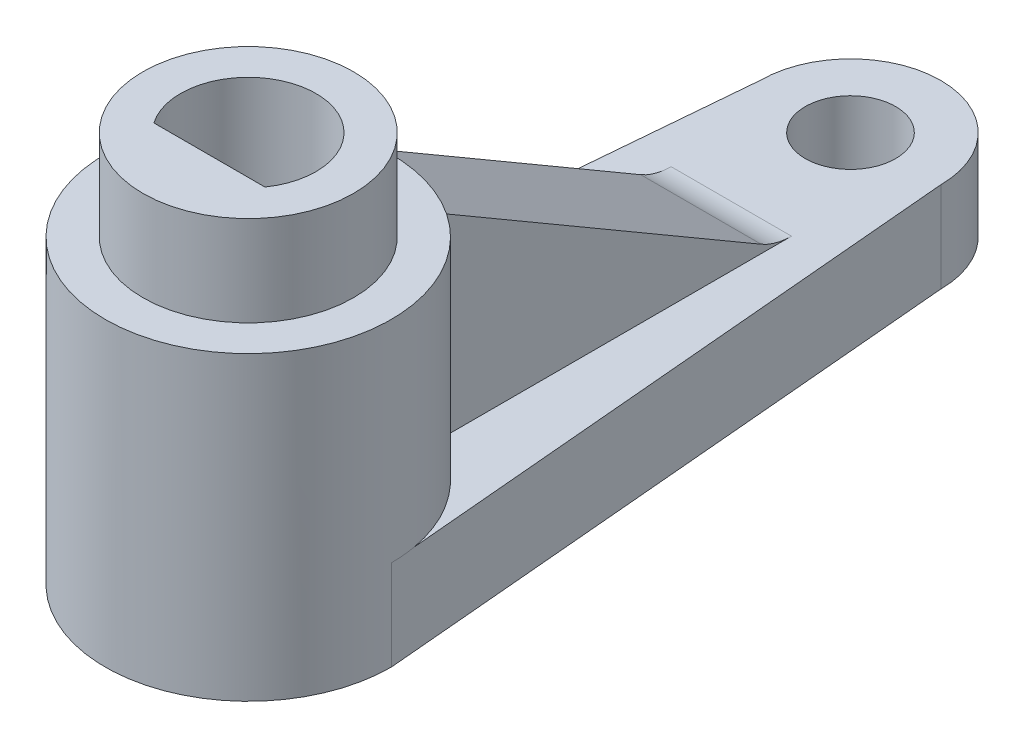
ISO-10303-21;
HEADER;
FILE_DESCRIPTION(('STEP AP214'),'2;1');
FILE_NAME('part.step','',(''),(''),'','','');
FILE_SCHEMA(('AUTOMOTIVE_DESIGN { 1 0 10303 214 1 1 1 1 }'));
ENDSEC;
DATA;
#1=APPLICATION_CONTEXT('core data for automotive mechanical design processes');
#2=APPLICATION_PROTOCOL_DEFINITION('international standard','automotive_design',2000,#1);
#3=PRODUCT_CONTEXT('',#1,'mechanical');
#4=PRODUCT('Part','Part','',(#3));
#5=PRODUCT_RELATED_PRODUCT_CATEGORY('part','',(#4));
#6=PRODUCT_DEFINITION_FORMATION('','',#4);
#7=PRODUCT_DEFINITION_CONTEXT('part definition',#1,'design');
#8=PRODUCT_DEFINITION('design','',#6,#7);
#9=PRODUCT_DEFINITION_SHAPE('','',#8);
#10=(LENGTH_UNIT() NAMED_UNIT(*) SI_UNIT(.MILLI.,.METRE.));
#11=(NAMED_UNIT(*) PLANE_ANGLE_UNIT() SI_UNIT($,.RADIAN.));
#12=(NAMED_UNIT(*) SI_UNIT($,.STERADIAN.) SOLID_ANGLE_UNIT());
#13=UNCERTAINTY_MEASURE_WITH_UNIT(LENGTH_MEASURE(1.E-05),#10,'distance_accuracy_value','');
#14=(GEOMETRIC_REPRESENTATION_CONTEXT(3) GLOBAL_UNCERTAINTY_ASSIGNED_CONTEXT((#13)) GLOBAL_UNIT_ASSIGNED_CONTEXT((#10,
#11,#12)) REPRESENTATION_CONTEXT('',''));
#15=CARTESIAN_POINT('',(0.,0.,0.));
#16=DIRECTION('',(0.,0.,1.));
#17=DIRECTION('',(1.,0.,0.));
#18=AXIS2_PLACEMENT_3D('',#15,#16,#17);
#19=CARTESIAN_POINT('',(0.,13.,0.));
#20=DIRECTION('',(0.,-1.,0.));
#21=DIRECTION('',(0.,0.,-1.));
#22=AXIS2_PLACEMENT_3D('',#19,#20,#21);
#23=CYLINDRICAL_SURFACE('',#22,3.5);
#24=CARTESIAN_POINT('',(0.,13.,0.));
#25=DIRECTION('',(0.,1.,0.));
#26=DIRECTION('',(0.,0.,1.));
#27=AXIS2_PLACEMENT_3D('',#24,#25,#26);
#28=CIRCLE('',#27,3.5);
#29=CARTESIAN_POINT('',(0.,13.,3.5));
#30=VERTEX_POINT('',#29);
#31=EDGE_CURVE('E244',#30,#30,#28,.T.);
#32=ORIENTED_EDGE('',*,*,#31,.F.);
#33=EDGE_LOOP('',(#32));
#34=FACE_BOUND('',#33,.T.);
#35=CARTESIAN_POINT('',(0.,10.,0.));
#36=DIRECTION('',(0.,1.,0.));
#37=DIRECTION('',(0.,0.,1.));
#38=AXIS2_PLACEMENT_3D('',#35,#36,#37);
#39=CIRCLE('',#38,3.5);
#40=CARTESIAN_POINT('',(0.,10.,3.5));
#41=VERTEX_POINT('',#40);
#42=EDGE_CURVE('E346',#41,#41,#39,.T.);
#43=ORIENTED_EDGE('',*,*,#42,.T.);
#44=EDGE_LOOP('',(#43));
#45=FACE_BOUND('',#44,.T.);
#46=ADVANCED_FACE('F45',(#34,#45),#23,.T.);
#47=CARTESIAN_POINT('',(0.,3.,0.));
#48=DIRECTION('',(0.,-1.,0.));
#49=DIRECTION('',(0.,0.,-1.));
#50=AXIS2_PLACEMENT_3D('',#47,#48,#49);
#51=CYLINDRICAL_SURFACE('',#50,2.25);
#52=DIRECTION('',(0.,-1.,0.));
#53=VECTOR('',#52,1.);
#54=CARTESIAN_POINT('',(-1.84347497948846,3.,1.29));
#55=LINE('',#54,#53);
#56=CARTESIAN_POINT('',(-1.84347497948846,13.,1.29));
#57=VERTEX_POINT('',#56);
#58=CARTESIAN_POINT('',(-1.84347497948846,1.5,1.29));
#59=VERTEX_POINT('',#58);
#60=EDGE_CURVE('E264',#57,#59,#55,.T.);
#61=ORIENTED_EDGE('',*,*,#60,.T.);
#62=CARTESIAN_POINT('',(0.,1.5,0.));
#63=DIRECTION('',(0.,-1.,0.));
#64=DIRECTION('',(0.,0.,-1.));
#65=AXIS2_PLACEMENT_3D('',#62,#63,#64);
#66=CIRCLE('',#65,2.25);
#67=CARTESIAN_POINT('',(1.84347497948846,1.5,1.29));
#68=VERTEX_POINT('',#67);
#69=EDGE_CURVE('E222',#59,#68,#66,.T.);
#70=ORIENTED_EDGE('',*,*,#69,.T.);
#71=DIRECTION('',(0.,-1.,0.));
#72=VECTOR('',#71,1.);
#73=CARTESIAN_POINT('',(1.84347497948846,3.,1.29));
#74=LINE('',#73,#72);
#75=CARTESIAN_POINT('',(1.84347497948846,13.,1.29));
#76=VERTEX_POINT('',#75);
#77=EDGE_CURVE('E286',#76,#68,#74,.T.);
#78=ORIENTED_EDGE('',*,*,#77,.F.);
#79=CARTESIAN_POINT('',(0.,13.,0.));
#80=DIRECTION('',(0.,1.,0.));
#81=DIRECTION('',(0.,0.,1.));
#82=AXIS2_PLACEMENT_3D('',#79,#80,#81);
#83=CIRCLE('',#82,2.25);
#84=EDGE_CURVE('E236',#76,#57,#83,.T.);
#85=ORIENTED_EDGE('',*,*,#84,.T.);
#86=EDGE_LOOP('',(#61,#70,#78,#85));
#87=FACE_BOUND('',#86,.T.);
#88=ADVANCED_FACE('F397',(#87),#51,.F.);
#89=CARTESIAN_POINT('',(0.,3.,1.29));
#90=DIRECTION('',(0.,0.,-1.));
#91=DIRECTION('',(-1.,0.,0.));
#92=AXIS2_PLACEMENT_3D('',#89,#90,#91);
#93=PLANE('',#92);
#94=ORIENTED_EDGE('',*,*,#77,.T.);
#95=DIRECTION('',(-1.,0.,0.));
#96=VECTOR('',#95,1.);
#97=CARTESIAN_POINT('',(0.,1.5,1.29));
#98=LINE('',#97,#96);
#99=EDGE_CURVE('E297',#68,#59,#98,.T.);
#100=ORIENTED_EDGE('',*,*,#99,.T.);
#101=ORIENTED_EDGE('',*,*,#60,.F.);
#102=DIRECTION('',(1.,0.,0.));
#103=VECTOR('',#102,1.);
#104=CARTESIAN_POINT('',(-1.84347497948846,13.,1.29));
#105=LINE('',#104,#103);
#106=EDGE_CURVE('E240',#57,#76,#105,.T.);
#107=ORIENTED_EDGE('',*,*,#106,.T.);
#108=EDGE_LOOP('',(#94,#100,#101,#107));
#109=FACE_BOUND('',#108,.T.);
#110=ADVANCED_FACE('F405',(#109),#93,.T.);
#111=CARTESIAN_POINT('',(0.,13.,0.));
#112=DIRECTION('',(0.,1.,0.));
#113=DIRECTION('',(0.,0.,1.));
#114=AXIS2_PLACEMENT_3D('',#111,#112,#113);
#115=PLANE('',#114);
#116=ORIENTED_EDGE('',*,*,#31,.T.);
#117=EDGE_LOOP('',(#116));
#118=FACE_BOUND('',#117,.T.);
#119=ORIENTED_EDGE('',*,*,#106,.F.);
#120=ORIENTED_EDGE('',*,*,#84,.F.);
#121=EDGE_LOOP('',(#119,#120));
#122=FACE_BOUND('',#121,.T.);
#123=ADVANCED_FACE('F412',(#118,#122),#115,.T.);
#124=CARTESIAN_POINT('',(0.,1.5,0.));
#125=DIRECTION('',(0.,-1.,0.));
#126=DIRECTION('',(0.,0.,-1.));
#127=AXIS2_PLACEMENT_3D('',#124,#125,#126);
#128=PLANE('',#127);
#129=ORIENTED_EDGE('',*,*,#69,.F.);
#130=ORIENTED_EDGE('',*,*,#99,.F.);
#131=EDGE_LOOP('',(#129,#130));
#132=FACE_BOUND('',#131,.T.);
#133=ADVANCED_FACE('F458',(#132),#128,.F.);
#134=CARTESIAN_POINT('',(0.,10.,0.));
#135=DIRECTION('',(0.,1.,0.));
#136=DIRECTION('',(0.,0.,1.));
#137=AXIS2_PLACEMENT_3D('',#134,#135,#136);
#138=PLANE('',#137);
#139=ORIENTED_EDGE('',*,*,#42,.F.);
#140=EDGE_LOOP('',(#139));
#141=FACE_BOUND('',#140,.T.);
#142=CARTESIAN_POINT('',(0.,10.,0.));
#143=DIRECTION('',(0.,1.,0.));
#144=DIRECTION('',(0.,0.,1.));
#145=AXIS2_PLACEMENT_3D('',#142,#143,#144);
#146=CIRCLE('',#145,4.75);
#147=CARTESIAN_POINT('',(0.,10.,4.75));
#148=VERTEX_POINT('',#147);
#149=EDGE_CURVE('E376',#148,#148,#146,.T.);
#150=ORIENTED_EDGE('',*,*,#149,.T.);
#151=EDGE_LOOP('',(#150));
#152=FACE_BOUND('',#151,.T.);
#153=ADVANCED_FACE('F383',(#141,#152),#138,.T.);
#154=CARTESIAN_POINT('',(0.,3.,0.));
#155=DIRECTION('',(0.,1.,0.));
#156=DIRECTION('',(0.,0.,1.));
#157=AXIS2_PLACEMENT_3D('',#154,#155,#156);
#158=PLANE('',#157);
#159=CARTESIAN_POINT('',(0.,3.,0.));
#160=DIRECTION('',(0.,1.,0.));
#161=DIRECTION('',(0.,0.,1.));
#162=AXIS2_PLACEMENT_3D('',#159,#160,#161);
#163=CIRCLE('',#162,4.75);
#164=CARTESIAN_POINT('',(-4.67781826639789,3.,-0.824934098309808));
#165=VERTEX_POINT('',#164);
#166=CARTESIAN_POINT('',(-4.75,3.,0.));
#167=VERTEX_POINT('',#166);
#168=EDGE_CURVE('E369',#165,#167,#163,.T.);
#169=ORIENTED_EDGE('',*,*,#168,.F.);
#170=DIRECTION('',(-0.0871669502809099,0.,0.996193717496113));
#171=VECTOR('',#170,1.);
#172=CARTESIAN_POINT('',(-4.71390913319894,3.,-0.412467049154908));
#173=LINE('',#172,#171);
#174=EDGE_CURVE('E69',#165,#167,#173,.T.);
#175=ORIENTED_EDGE('',*,*,#174,.T.);
#176=EDGE_LOOP('',(#169,#175));
#177=FACE_BOUND('',#176,.T.);
#178=ADVANCED_FACE('F444',(#177),#158,.F.);
#179=DIRECTION('',(0.0871669502809099,0.,0.996193717496113));
#180=VECTOR('',#179,1.);
#181=CARTESIAN_POINT('',(4.71390913319894,3.,-0.412467049154908));
#182=LINE('',#181,#180);
#183=CARTESIAN_POINT('',(4.67781826639789,3.,-0.824934098309808));
#184=VERTEX_POINT('',#183);
#185=CARTESIAN_POINT('',(4.75,3.,0.));
#186=VERTEX_POINT('',#185);
#187=EDGE_CURVE('E195',#184,#186,#182,.T.);
#188=ORIENTED_EDGE('',*,*,#187,.F.);
#189=EDGE_CURVE('E373',#186,#184,#163,.T.);
#190=ORIENTED_EDGE('',*,*,#189,.F.);
#191=EDGE_LOOP('',(#188,#190));
#192=FACE_BOUND('',#191,.T.);
#193=ADVANCED_FACE('F442',(#192),#158,.F.);
#194=CARTESIAN_POINT('',(0.,1.,0.));
#195=DIRECTION('',(0.,1.,0.));
#196=DIRECTION('',(0.,0.,1.));
#197=AXIS2_PLACEMENT_3D('',#194,#195,#196);
#198=PLANE('',#197);
#199=DIRECTION('',(-1.,0.,0.));
#200=VECTOR('',#199,1.);
#201=CARTESIAN_POINT('',(3.,1.,2.));
#202=LINE('',#201,#200);
#203=CARTESIAN_POINT('',(1.22930936742544,1.,2.));
#204=VERTEX_POINT('',#203);
#205=CARTESIAN_POINT('',(-1.22930936742545,1.,2.));
#206=VERTEX_POINT('',#205);
#207=EDGE_CURVE('E213',#204,#206,#202,.T.);
#208=ORIENTED_EDGE('',*,*,#207,.T.);
#209=CARTESIAN_POINT('',(-1.22930936742544,1.,0.5));
#210=DIRECTION('',(0.,1.,0.));
#211=DIRECTION('',(0.,0.,1.));
#212=AXIS2_PLACEMENT_3D('',#209,#210,#211);
#213=CIRCLE('',#212,1.5);
#214=CARTESIAN_POINT('',(-2.70890025317366,1.,0.253401519041964));
#215=VERTEX_POINT('',#214);
#216=EDGE_CURVE('E327',#206,#215,#213,.F.);
#217=ORIENTED_EDGE('',*,*,#216,.T.);
#218=DIRECTION('',(0.164398987305357,0.,-0.986393923832144));
#219=VECTOR('',#218,1.);
#220=CARTESIAN_POINT('',(-3.,1.,2.));
#221=LINE('',#220,#219);
#222=CARTESIAN_POINT('',(-1.47959088574821,1.,-7.1224546855107));
#223=VERTEX_POINT('',#222);
#224=EDGE_CURVE('E218',#215,#223,#221,.T.);
#225=ORIENTED_EDGE('',*,*,#224,.T.);
#226=CARTESIAN_POINT('',(0.,1.,-6.87585620455267));
#227=DIRECTION('',(0.,1.,0.));
#228=DIRECTION('',(0.,0.,1.));
#229=AXIS2_PLACEMENT_3D('',#226,#227,#228);
#230=CIRCLE('',#229,1.5);
#231=CARTESIAN_POINT('',(1.47959088574822,1.,-7.12245468551071));
#232=VERTEX_POINT('',#231);
#233=EDGE_CURVE('E321',#223,#232,#230,.F.);
#234=ORIENTED_EDGE('',*,*,#233,.T.);
#235=DIRECTION('',(0.164398987305357,0.,0.986393923832144));
#236=VECTOR('',#235,1.);
#237=CARTESIAN_POINT('',(3.,1.,2.));
#238=LINE('',#237,#236);
#239=CARTESIAN_POINT('',(2.70890025317366,1.,0.253401519041965));
#240=VERTEX_POINT('',#239);
#241=EDGE_CURVE('E209',#232,#240,#238,.T.);
#242=ORIENTED_EDGE('',*,*,#241,.T.);
#243=CARTESIAN_POINT('',(1.22930936742544,1.,0.5));
#244=DIRECTION('',(0.,1.,0.));
#245=DIRECTION('',(0.,0.,1.));
#246=AXIS2_PLACEMENT_3D('',#243,#244,#245);
#247=CIRCLE('',#246,1.5);
#248=EDGE_CURVE('E324',#240,#204,#247,.F.);
#249=ORIENTED_EDGE('',*,*,#248,.T.);
#250=EDGE_LOOP('',(#208,#217,#225,#234,#242,#249));
#251=FACE_BOUND('',#250,.T.);
#252=ADVANCED_FACE('F443',(#251),#198,.F.);
#253=CARTESIAN_POINT('',(-1.22930936742544,1.,0.5));
#254=DIRECTION('',(0.,1.,0.));
#255=DIRECTION('',(0.,0.,1.));
#256=AXIS2_PLACEMENT_3D('',#253,#254,#255);
#257=CYLINDRICAL_SURFACE('',#256,1.5);
#258=ORIENTED_EDGE('',*,*,#216,.F.);
#259=DIRECTION('',(0.,-1.,0.));
#260=VECTOR('',#259,1.);
#261=CARTESIAN_POINT('',(-1.22930936742545,1.,2.));
#262=LINE('',#261,#260);
#263=CARTESIAN_POINT('',(-1.22930936742545,0.,2.));
#264=VERTEX_POINT('',#263);
#265=EDGE_CURVE('E318',#264,#206,#262,.F.);
#266=ORIENTED_EDGE('',*,*,#265,.F.);
#267=CARTESIAN_POINT('',(-1.22930936742544,0.,0.5));
#268=DIRECTION('',(0.,1.,0.));
#269=DIRECTION('',(0.,0.,1.));
#270=AXIS2_PLACEMENT_3D('',#267,#268,#269);
#271=CIRCLE('',#270,1.5);
#272=CARTESIAN_POINT('',(-2.70890025317366,0.,0.253401519041964));
#273=VERTEX_POINT('',#272);
#274=EDGE_CURVE('E337',#273,#264,#271,.T.);
#275=ORIENTED_EDGE('',*,*,#274,.F.);
#276=DIRECTION('',(0.,-1.,0.));
#277=VECTOR('',#276,1.);
#278=CARTESIAN_POINT('',(-2.70890025317366,0.,0.253401519041964));
#279=LINE('',#278,#277);
#280=EDGE_CURVE('E310',#215,#273,#279,.T.);
#281=ORIENTED_EDGE('',*,*,#280,.F.);
#282=EDGE_LOOP('',(#258,#266,#275,#281));
#283=FACE_BOUND('',#282,.T.);
#284=ADVANCED_FACE('F450',(#283),#257,.F.);
#285=CARTESIAN_POINT('',(-3.,1.,2.));
#286=DIRECTION('',(-0.986393923832144,0.,-0.164398987305357));
#287=DIRECTION('',(-0.164398987305357,0.,0.986393923832144));
#288=AXIS2_PLACEMENT_3D('',#285,#286,#287);
#289=PLANE('',#288);
#290=ORIENTED_EDGE('',*,*,#224,.F.);
#291=ORIENTED_EDGE('',*,*,#280,.T.);
#292=DIRECTION('',(0.164398987305357,0.,-0.986393923832144));
#293=VECTOR('',#292,1.);
#294=CARTESIAN_POINT('',(-3.,0.,2.));
#295=LINE('',#294,#293);
#296=CARTESIAN_POINT('',(-1.47959088574821,0.,-7.1224546855107));
#297=VERTEX_POINT('',#296);
#298=EDGE_CURVE('E214',#273,#297,#295,.T.);
#299=ORIENTED_EDGE('',*,*,#298,.T.);
#300=DIRECTION('',(0.,-1.,0.));
#301=VECTOR('',#300,1.);
#302=CARTESIAN_POINT('',(-1.47959088574821,1.,-7.12245468551071));
#303=LINE('',#302,#301);
#304=EDGE_CURVE('E307',#297,#223,#303,.F.);
#305=ORIENTED_EDGE('',*,*,#304,.T.);
#306=EDGE_LOOP('',(#290,#291,#299,#305));
#307=FACE_BOUND('',#306,.T.);
#308=ADVANCED_FACE('F462',(#307),#289,.F.);
#309=CARTESIAN_POINT('',(0.,1.,-6.87585620455267));
#310=DIRECTION('',(0.,1.,0.));
#311=DIRECTION('',(0.,0.,1.));
#312=AXIS2_PLACEMENT_3D('',#309,#310,#311);
#313=CYLINDRICAL_SURFACE('',#312,1.5);
#314=ORIENTED_EDGE('',*,*,#233,.F.);
#315=ORIENTED_EDGE('',*,*,#304,.F.);
#316=CARTESIAN_POINT('',(0.,0.,-6.87585620455267));
#317=DIRECTION('',(0.,1.,0.));
#318=DIRECTION('',(0.,0.,1.));
#319=AXIS2_PLACEMENT_3D('',#316,#317,#318);
#320=CIRCLE('',#319,1.5);
#321=CARTESIAN_POINT('',(1.47959088574822,0.,-7.12245468551071));
#322=VERTEX_POINT('',#321);
#323=EDGE_CURVE('E343',#322,#297,#320,.T.);
#324=ORIENTED_EDGE('',*,*,#323,.F.);
#325=DIRECTION('',(0.,-1.,0.));
#326=VECTOR('',#325,1.);
#327=CARTESIAN_POINT('',(1.47959088574822,0.,-7.1224546855107));
#328=LINE('',#327,#326);
#329=EDGE_CURVE('E330',#232,#322,#328,.T.);
#330=ORIENTED_EDGE('',*,*,#329,.F.);
#331=EDGE_LOOP('',(#314,#315,#324,#330));
#332=FACE_BOUND('',#331,.T.);
#333=ADVANCED_FACE('F465',(#332),#313,.F.);
#334=CARTESIAN_POINT('',(3.,1.,2.));
#335=DIRECTION('',(0.986393923832144,0.,-0.164398987305357));
#336=DIRECTION('',(-0.164398987305357,0.,-0.986393923832144));
#337=AXIS2_PLACEMENT_3D('',#334,#335,#336);
#338=PLANE('',#337);
#339=DIRECTION('',(0.164398987305357,0.,0.986393923832144));
#340=VECTOR('',#339,1.);
#341=CARTESIAN_POINT('',(3.,0.,2.));
#342=LINE('',#341,#340);
#343=CARTESIAN_POINT('',(2.70890025317366,0.,0.253401519041965));
#344=VERTEX_POINT('',#343);
#345=EDGE_CURVE('E208',#322,#344,#342,.T.);
#346=ORIENTED_EDGE('',*,*,#345,.T.);
#347=DIRECTION('',(0.,-1.,0.));
#348=VECTOR('',#347,1.);
#349=CARTESIAN_POINT('',(2.70890025317366,1.,0.253401519041965));
#350=LINE('',#349,#348);
#351=EDGE_CURVE('E334',#344,#240,#350,.F.);
#352=ORIENTED_EDGE('',*,*,#351,.T.);
#353=ORIENTED_EDGE('',*,*,#241,.F.);
#354=ORIENTED_EDGE('',*,*,#329,.T.);
#355=EDGE_LOOP('',(#346,#352,#353,#354));
#356=FACE_BOUND('',#355,.T.);
#357=ADVANCED_FACE('F472',(#356),#338,.F.);
#358=CARTESIAN_POINT('',(1.22930936742544,1.,0.5));
#359=DIRECTION('',(0.,1.,0.));
#360=DIRECTION('',(0.,0.,1.));
#361=AXIS2_PLACEMENT_3D('',#358,#359,#360);
#362=CYLINDRICAL_SURFACE('',#361,1.5);
#363=ORIENTED_EDGE('',*,*,#248,.F.);
#364=ORIENTED_EDGE('',*,*,#351,.F.);
#365=CARTESIAN_POINT('',(1.22930936742544,0.,0.5));
#366=DIRECTION('',(0.,1.,0.));
#367=DIRECTION('',(0.,0.,1.));
#368=AXIS2_PLACEMENT_3D('',#365,#366,#367);
#369=CIRCLE('',#368,1.5);
#370=CARTESIAN_POINT('',(1.22930936742544,0.,2.));
#371=VERTEX_POINT('',#370);
#372=EDGE_CURVE('E340',#371,#344,#369,.T.);
#373=ORIENTED_EDGE('',*,*,#372,.F.);
#374=DIRECTION('',(0.,-1.,0.));
#375=VECTOR('',#374,1.);
#376=CARTESIAN_POINT('',(1.22930936742544,0.,2.));
#377=LINE('',#376,#375);
#378=EDGE_CURVE('E314',#204,#371,#377,.T.);
#379=ORIENTED_EDGE('',*,*,#378,.F.);
#380=EDGE_LOOP('',(#363,#364,#373,#379));
#381=FACE_BOUND('',#380,.T.);
#382=ADVANCED_FACE('F470',(#381),#362,.F.);
#383=CARTESIAN_POINT('',(3.,1.,2.));
#384=DIRECTION('',(0.,0.,1.));
#385=DIRECTION('',(1.,0.,0.));
#386=AXIS2_PLACEMENT_3D('',#383,#384,#385);
#387=PLANE('',#386);
#388=DIRECTION('',(-1.,0.,0.));
#389=VECTOR('',#388,1.);
#390=CARTESIAN_POINT('',(3.,0.,2.));
#391=LINE('',#390,#389);
#392=EDGE_CURVE('E226',#371,#264,#391,.T.);
#393=ORIENTED_EDGE('',*,*,#392,.T.);
#394=ORIENTED_EDGE('',*,*,#265,.T.);
#395=ORIENTED_EDGE('',*,*,#207,.F.);
#396=ORIENTED_EDGE('',*,*,#378,.T.);
#397=EDGE_LOOP('',(#393,#394,#395,#396));
#398=FACE_BOUND('',#397,.T.);
#399=ADVANCED_FACE('F467',(#398),#387,.F.);
#400=CARTESIAN_POINT('',(0.,3.,-20.));
#401=DIRECTION('',(0.,-1.,0.));
#402=DIRECTION('',(0.,0.,-1.));
#403=AXIS2_PLACEMENT_3D('',#400,#401,#402);
#404=CYLINDRICAL_SURFACE('',#403,1.5);
#405=CARTESIAN_POINT('',(0.,3.,-20.));
#406=DIRECTION('',(0.,1.,0.));
#407=DIRECTION('',(0.,0.,1.));
#408=AXIS2_PLACEMENT_3D('',#405,#406,#407);
#409=CIRCLE('',#408,1.5);
#410=CARTESIAN_POINT('',(0.,3.,-18.5));
#411=VERTEX_POINT('',#410);
#412=EDGE_CURVE('E249',#411,#411,#409,.T.);
#413=ORIENTED_EDGE('',*,*,#412,.T.);
#414=EDGE_LOOP('',(#413));
#415=FACE_BOUND('',#414,.T.);
#416=CARTESIAN_POINT('',(0.,0.,-20.));
#417=DIRECTION('',(0.,1.,0.));
#418=DIRECTION('',(0.,0.,1.));
#419=AXIS2_PLACEMENT_3D('',#416,#417,#418);
#420=CIRCLE('',#419,1.5);
#421=CARTESIAN_POINT('',(0.,0.,-18.5));
#422=VERTEX_POINT('',#421);
#423=EDGE_CURVE('E248',#422,#422,#420,.T.);
#424=ORIENTED_EDGE('',*,*,#423,.F.);
#425=EDGE_LOOP('',(#424));
#426=FACE_BOUND('',#425,.T.);
#427=ADVANCED_FACE('F426',(#415,#426),#404,.F.);
#428=CARTESIAN_POINT('',(0.,3.,-20.));
#429=DIRECTION('',(0.,-1.,0.));
#430=DIRECTION('',(0.,0.,-1.));
#431=AXIS2_PLACEMENT_3D('',#428,#429,#430);
#432=CYLINDRICAL_SURFACE('',#431,3.);
#433=CARTESIAN_POINT('',(0.,0.,-20.));
#434=DIRECTION('',(0.,1.,0.));
#435=DIRECTION('',(0.,0.,1.));
#436=AXIS2_PLACEMENT_3D('',#433,#434,#435);
#437=CIRCLE('',#436,3.);
#438=CARTESIAN_POINT('',(3.,0.,-20.));
#439=VERTEX_POINT('',#438);
#440=CARTESIAN_POINT('',(-3.,0.,-20.));
#441=VERTEX_POINT('',#440);
#442=EDGE_CURVE('E272',#439,#441,#437,.T.);
#443=ORIENTED_EDGE('',*,*,#442,.T.);
#444=DIRECTION('',(0.,-1.,0.));
#445=VECTOR('',#444,1.);
#446=CARTESIAN_POINT('',(-3.,3.,-20.));
#447=LINE('',#446,#445);
#448=CARTESIAN_POINT('',(-3.,3.,-20.));
#449=VERTEX_POINT('',#448);
#450=EDGE_CURVE('E290',#449,#441,#447,.T.);
#451=ORIENTED_EDGE('',*,*,#450,.F.);
#452=CARTESIAN_POINT('',(0.,3.,-20.));
#453=DIRECTION('',(0.,1.,0.));
#454=DIRECTION('',(0.,0.,1.));
#455=AXIS2_PLACEMENT_3D('',#452,#453,#454);
#456=CIRCLE('',#455,3.);
#457=CARTESIAN_POINT('',(3.,3.,-20.));
#458=VERTEX_POINT('',#457);
#459=EDGE_CURVE('E257',#458,#449,#456,.T.);
#460=ORIENTED_EDGE('',*,*,#459,.F.);
#461=DIRECTION('',(0.,-1.,0.));
#462=VECTOR('',#461,1.);
#463=CARTESIAN_POINT('',(3.,3.,-20.));
#464=LINE('',#463,#462);
#465=EDGE_CURVE('E294',#458,#439,#464,.T.);
#466=ORIENTED_EDGE('',*,*,#465,.T.);
#467=EDGE_LOOP('',(#443,#451,#460,#466));
#468=FACE_BOUND('',#467,.T.);
#469=ADVANCED_FACE('F418',(#468),#432,.T.);
#470=CARTESIAN_POINT('',(0.,0.,0.));
#471=DIRECTION('',(0.,1.,0.));
#472=DIRECTION('',(0.,0.,1.));
#473=AXIS2_PLACEMENT_3D('',#470,#471,#472);
#474=PLANE('',#473);
#475=ORIENTED_EDGE('',*,*,#392,.F.);
#476=ORIENTED_EDGE('',*,*,#372,.T.);
#477=ORIENTED_EDGE('',*,*,#345,.F.);
#478=ORIENTED_EDGE('',*,*,#323,.T.);
#479=ORIENTED_EDGE('',*,*,#298,.F.);
#480=ORIENTED_EDGE('',*,*,#274,.T.);
#481=EDGE_LOOP('',(#475,#476,#477,#478,#479,#480));
#482=FACE_BOUND('',#481,.T.);
#483=ORIENTED_EDGE('',*,*,#423,.T.);
#484=EDGE_LOOP('',(#483));
#485=FACE_BOUND('',#484,.T.);
#486=DIRECTION('',(0.0871669502809099,0.,0.996193717496113));
#487=VECTOR('',#486,1.);
#488=CARTESIAN_POINT('',(4.71390913319894,0.,-0.412467049154908));
#489=LINE('',#488,#487);
#490=CARTESIAN_POINT('',(4.75,0.,0.));
#491=VERTEX_POINT('',#490);
#492=EDGE_CURVE('E268',#439,#491,#489,.T.);
#493=ORIENTED_EDGE('',*,*,#492,.T.);
#494=CARTESIAN_POINT('',(0.,0.,0.));
#495=DIRECTION('',(0.,1.,0.));
#496=DIRECTION('',(0.,0.,1.));
#497=AXIS2_PLACEMENT_3D('',#494,#495,#496);
#498=CIRCLE('',#497,4.75);
#499=CARTESIAN_POINT('',(-4.75,0.,0.));
#500=VERTEX_POINT('',#499);
#501=EDGE_CURVE('E254',#500,#491,#498,.T.);
#502=ORIENTED_EDGE('',*,*,#501,.F.);
#503=DIRECTION('',(-0.0871669502809099,0.,0.996193717496113));
#504=VECTOR('',#503,1.);
#505=CARTESIAN_POINT('',(-4.71390913319894,0.,-0.412467049154908));
#506=LINE('',#505,#504);
#507=EDGE_CURVE('E276',#441,#500,#506,.T.);
#508=ORIENTED_EDGE('',*,*,#507,.F.);
#509=ORIENTED_EDGE('',*,*,#442,.F.);
#510=EDGE_LOOP('',(#493,#502,#508,#509));
#511=FACE_BOUND('',#510,.T.);
#512=ADVANCED_FACE('F416',(#482,#485,#511),#474,.F.);
#513=CARTESIAN_POINT('',(-5.,5.,-16.0406982826999));
#514=DIRECTION('',(-1.,0.,0.));
#515=DIRECTION('',(0.,0.,1.));
#516=AXIS2_PLACEMENT_3D('',#513,#514,#515);
#517=CYLINDRICAL_SURFACE('',#516,2.);
#518=CARTESIAN_POINT('',(2.,5.,-16.0406982826999));
#519=DIRECTION('',(-1.,0.,0.));
#520=DIRECTION('',(0.,0.,1.));
#521=AXIS2_PLACEMENT_3D('',#518,#519,#520);
#522=CIRCLE('',#521,2.);
#523=CARTESIAN_POINT('',(2.,3.,-16.0406982826999));
#524=VERTEX_POINT('',#523);
#525=CARTESIAN_POINT('',(2.,3.27244219820313,-15.0329562316518));
#526=VERTEX_POINT('',#525);
#527=EDGE_CURVE('E54',#524,#526,#522,.T.);
#528=ORIENTED_EDGE('',*,*,#527,.F.);
#529=DIRECTION('',(-1.,0.,0.));
#530=VECTOR('',#529,1.);
#531=CARTESIAN_POINT('',(0.,3.,-16.0406982826999));
#532=LINE('',#531,#530);
#533=CARTESIAN_POINT('',(-2.,3.,-16.0406982826999));
#534=VERTEX_POINT('',#533);
#535=EDGE_CURVE('E352',#534,#524,#532,.F.);
#536=ORIENTED_EDGE('',*,*,#535,.F.);
#537=CARTESIAN_POINT('',(-2.,5.,-16.0406982826999));
#538=DIRECTION('',(1.,0.,0.));
#539=DIRECTION('',(0.,0.,-1.));
#540=AXIS2_PLACEMENT_3D('',#537,#538,#539);
#541=CIRCLE('',#540,2.);
#542=CARTESIAN_POINT('',(-2.,3.27244219820313,-15.0329562316518));
#543=VERTEX_POINT('',#542);
#544=EDGE_CURVE('E356',#543,#534,#541,.T.);
#545=ORIENTED_EDGE('',*,*,#544,.F.);
#546=DIRECTION('',(-1.,0.,0.));
#547=VECTOR('',#546,1.);
#548=CARTESIAN_POINT('',(-5.,3.27244219820313,-15.0329562316518));
#549=LINE('',#548,#547);
#550=EDGE_CURVE('E171',#526,#543,#549,.T.);
#551=ORIENTED_EDGE('',*,*,#550,.F.);
#552=EDGE_LOOP('',(#528,#536,#545,#551));
#553=FACE_BOUND('',#552,.T.);
#554=ADVANCED_FACE('F47',(#553),#517,.F.);
#555=CARTESIAN_POINT('',(-5.,10.,-3.5));
#556=DIRECTION('',(0.,-0.863778900898433,0.503871025524086));
#557=DIRECTION('',(0.,-0.503871025524086,-0.863778900898434));
#558=AXIS2_PLACEMENT_3D('',#555,#556,#557);
#559=PLANE('',#558);
#560=CARTESIAN_POINT('',(0.,12.0416666666667,0.));
#561=DIRECTION('',(0.,-0.863778900898433,0.503871025524086));
#562=DIRECTION('',(0.,-0.503871025524086,-0.863778900898434));
#563=AXIS2_PLACEMENT_3D('',#560,#561,#562);
#564=ELLIPSE('',#563,5.49909241249055,4.75);
#565=CARTESIAN_POINT('',(2.,9.52842050880628,-4.30842198490352));
#566=VERTEX_POINT('',#565);
#567=CARTESIAN_POINT('',(-2.,9.52842050880628,-4.30842198490352));
#568=VERTEX_POINT('',#567);
#569=EDGE_CURVE('E11',#566,#568,#564,.F.);
#570=ORIENTED_EDGE('',*,*,#569,.F.);
#571=DIRECTION('',(0.,-0.503871025524086,-0.863778900898433));
#572=VECTOR('',#571,1.);
#573=CARTESIAN_POINT('',(2.,10.,-3.5));
#574=LINE('',#573,#572);
#575=EDGE_CURVE('E177',#566,#526,#574,.T.);
#576=ORIENTED_EDGE('',*,*,#575,.T.);
#577=ORIENTED_EDGE('',*,*,#550,.T.);
#578=DIRECTION('',(0.,-0.503871025524086,-0.863778900898434));
#579=VECTOR('',#578,1.);
#580=CARTESIAN_POINT('',(-2.,4.77720207253886,-12.4533678756477));
#581=LINE('',#580,#579);
#582=EDGE_CURVE('E166',#568,#543,#581,.T.);
#583=ORIENTED_EDGE('',*,*,#582,.F.);
#584=EDGE_LOOP('',(#570,#576,#577,#583));
#585=FACE_BOUND('',#584,.T.);
#586=ADVANCED_FACE('F168',(#585),#559,.F.);
#587=CARTESIAN_POINT('',(2.,10.,-15.5));
#588=DIRECTION('',(-1.,0.,0.));
#589=DIRECTION('',(0.,0.,1.));
#590=AXIS2_PLACEMENT_3D('',#587,#588,#589);
#591=PLANE('',#590);
#592=DIRECTION('',(0.,-1.,0.));
#593=VECTOR('',#592,1.);
#594=CARTESIAN_POINT('',(2.,10.,-4.30842198490352));
#595=LINE('',#594,#593);
#596=CARTESIAN_POINT('',(2.,3.,-4.30842198490352));
#597=VERTEX_POINT('',#596);
#598=EDGE_CURVE('E186',#597,#566,#595,.F.);
#599=ORIENTED_EDGE('',*,*,#598,.F.);
#600=DIRECTION('',(0.,0.,-1.));
#601=VECTOR('',#600,1.);
#602=CARTESIAN_POINT('',(2.,3.,-15.5));
#603=LINE('',#602,#601);
#604=EDGE_CURVE('E205',#597,#524,#603,.T.);
#605=ORIENTED_EDGE('',*,*,#604,.T.);
#606=ORIENTED_EDGE('',*,*,#527,.T.);
#607=ORIENTED_EDGE('',*,*,#575,.F.);
#608=EDGE_LOOP('',(#599,#605,#606,#607));
#609=FACE_BOUND('',#608,.T.);
#610=ADVANCED_FACE('F361',(#609),#591,.F.);
#611=CARTESIAN_POINT('',(-2.,10.,-15.5));
#612=DIRECTION('',(1.,0.,0.));
#613=DIRECTION('',(0.,0.,-1.));
#614=AXIS2_PLACEMENT_3D('',#611,#612,#613);
#615=PLANE('',#614);
#616=DIRECTION('',(0.,-1.,0.));
#617=VECTOR('',#616,1.);
#618=CARTESIAN_POINT('',(-2.,10.,-4.30842198490352));
#619=LINE('',#618,#617);
#620=CARTESIAN_POINT('',(-2.,3.,-4.30842198490352));
#621=VERTEX_POINT('',#620);
#622=EDGE_CURVE('E181',#568,#621,#619,.T.);
#623=ORIENTED_EDGE('',*,*,#622,.F.);
#624=ORIENTED_EDGE('',*,*,#582,.T.);
#625=ORIENTED_EDGE('',*,*,#544,.T.);
#626=DIRECTION('',(0.,0.,1.));
#627=VECTOR('',#626,1.);
#628=CARTESIAN_POINT('',(-2.,3.,-15.5));
#629=LINE('',#628,#627);
#630=EDGE_CURVE('E176',#534,#621,#629,.T.);
#631=ORIENTED_EDGE('',*,*,#630,.T.);
#632=EDGE_LOOP('',(#623,#624,#625,#631));
#633=FACE_BOUND('',#632,.T.);
#634=ADVANCED_FACE('F182',(#633),#615,.F.);
#635=CARTESIAN_POINT('',(0.,3.,0.));
#636=DIRECTION('',(0.,-1.,0.));
#637=DIRECTION('',(0.,0.,-1.));
#638=AXIS2_PLACEMENT_3D('',#635,#636,#637);
#639=CYLINDRICAL_SURFACE('',#638,4.75);
#640=ORIENTED_EDGE('',*,*,#501,.T.);
#641=DIRECTION('',(0.,-1.,0.));
#642=VECTOR('',#641,1.);
#643=CARTESIAN_POINT('',(4.75,3.,0.));
#644=LINE('',#643,#642);
#645=EDGE_CURVE('E282',#186,#491,#644,.T.);
#646=ORIENTED_EDGE('',*,*,#645,.F.);
#647=ORIENTED_EDGE('',*,*,#189,.T.);
#648=EDGE_CURVE('E61',#184,#597,#163,.T.);
#649=ORIENTED_EDGE('',*,*,#648,.T.);
#650=ORIENTED_EDGE('',*,*,#598,.T.);
#651=ORIENTED_EDGE('',*,*,#569,.T.);
#652=ORIENTED_EDGE('',*,*,#622,.T.);
#653=EDGE_CURVE('E365',#621,#165,#163,.T.);
#654=ORIENTED_EDGE('',*,*,#653,.T.);
#655=ORIENTED_EDGE('',*,*,#168,.T.);
#656=DIRECTION('',(0.,-1.,0.));
#657=VECTOR('',#656,1.);
#658=CARTESIAN_POINT('',(-4.75,3.,0.));
#659=LINE('',#658,#657);
#660=EDGE_CURVE('E285',#167,#500,#659,.T.);
#661=ORIENTED_EDGE('',*,*,#660,.T.);
#662=EDGE_LOOP('',(#640,#646,#647,#649,#650,#651,#652,#654,#655,#661));
#663=FACE_BOUND('',#662,.T.);
#664=ORIENTED_EDGE('',*,*,#149,.F.);
#665=EDGE_LOOP('',(#664));
#666=FACE_BOUND('',#665,.T.);
#667=ADVANCED_FACE('F190',(#663,#666),#639,.T.);
#668=CARTESIAN_POINT('',(-4.71390913319894,3.,-0.412467049154908));
#669=DIRECTION('',(0.996193717496113,0.,0.0871669502809099));
#670=DIRECTION('',(0.0871669502809099,0.,-0.996193717496113));
#671=AXIS2_PLACEMENT_3D('',#668,#669,#670);
#672=PLANE('',#671);
#673=ORIENTED_EDGE('',*,*,#507,.T.);
#674=ORIENTED_EDGE('',*,*,#660,.F.);
#675=ORIENTED_EDGE('',*,*,#174,.F.);
#676=DIRECTION('',(-0.0871669502809099,0.,0.996193717496113));
#677=VECTOR('',#676,1.);
#678=CARTESIAN_POINT('',(-4.71390913319894,3.,-0.412467049154908));
#679=LINE('',#678,#677);
#680=EDGE_CURVE('E261',#449,#165,#679,.T.);
#681=ORIENTED_EDGE('',*,*,#680,.F.);
#682=ORIENTED_EDGE('',*,*,#450,.T.);
#683=EDGE_LOOP('',(#673,#674,#675,#681,#682));
#684=FACE_BOUND('',#683,.T.);
#685=ADVANCED_FACE('F385',(#684),#672,.F.);
#686=CARTESIAN_POINT('',(4.71390913319894,3.,-0.412467049154908));
#687=DIRECTION('',(0.996193717496113,0.,-0.0871669502809099));
#688=DIRECTION('',(-0.0871669502809099,0.,-0.996193717496113));
#689=AXIS2_PLACEMENT_3D('',#686,#687,#688);
#690=PLANE('',#689);
#691=ORIENTED_EDGE('',*,*,#492,.F.);
#692=ORIENTED_EDGE('',*,*,#465,.F.);
#693=DIRECTION('',(0.0871669502809099,0.,0.996193717496113));
#694=VECTOR('',#693,1.);
#695=CARTESIAN_POINT('',(4.71390913319894,3.,-0.412467049154908));
#696=LINE('',#695,#694);
#697=EDGE_CURVE('E253',#458,#184,#696,.T.);
#698=ORIENTED_EDGE('',*,*,#697,.T.);
#699=ORIENTED_EDGE('',*,*,#187,.T.);
#700=ORIENTED_EDGE('',*,*,#645,.T.);
#701=EDGE_LOOP('',(#691,#692,#698,#699,#700));
#702=FACE_BOUND('',#701,.T.);
#703=ADVANCED_FACE('F391',(#702),#690,.T.);
#704=CARTESIAN_POINT('',(0.,3.,0.));
#705=DIRECTION('',(0.,1.,0.));
#706=DIRECTION('',(0.,0.,1.));
#707=AXIS2_PLACEMENT_3D('',#704,#705,#706);
#708=PLANE('',#707);
#709=ORIENTED_EDGE('',*,*,#412,.F.);
#710=EDGE_LOOP('',(#709));
#711=FACE_BOUND('',#710,.T.);
#712=ORIENTED_EDGE('',*,*,#680,.T.);
#713=ORIENTED_EDGE('',*,*,#653,.F.);
#714=ORIENTED_EDGE('',*,*,#630,.F.);
#715=ORIENTED_EDGE('',*,*,#535,.T.);
#716=ORIENTED_EDGE('',*,*,#604,.F.);
#717=ORIENTED_EDGE('',*,*,#648,.F.);
#718=ORIENTED_EDGE('',*,*,#697,.F.);
#719=ORIENTED_EDGE('',*,*,#459,.T.);
#720=EDGE_LOOP('',(#712,#713,#714,#715,#716,#717,#718,#719));
#721=FACE_BOUND('',#720,.T.);
#722=ADVANCED_FACE('F364',(#711,#721),#708,.T.);
#723=CLOSED_SHELL('',(#46,#88,#110,#123,#133,#153,#178,#193,#252,#284,#308,#333,#357,#382,#399,
#427,#469,#512,#554,#586,#610,#634,#667,#685,#703,#722));
#724=MANIFOLD_SOLID_BREP('B2',#723);
#725=ADVANCED_BREP_SHAPE_REPRESENTATION('',(#18,#724),#14);
#726=SHAPE_DEFINITION_REPRESENTATION(#9,#725);
ENDSEC;
END-ISO-10303-21;
